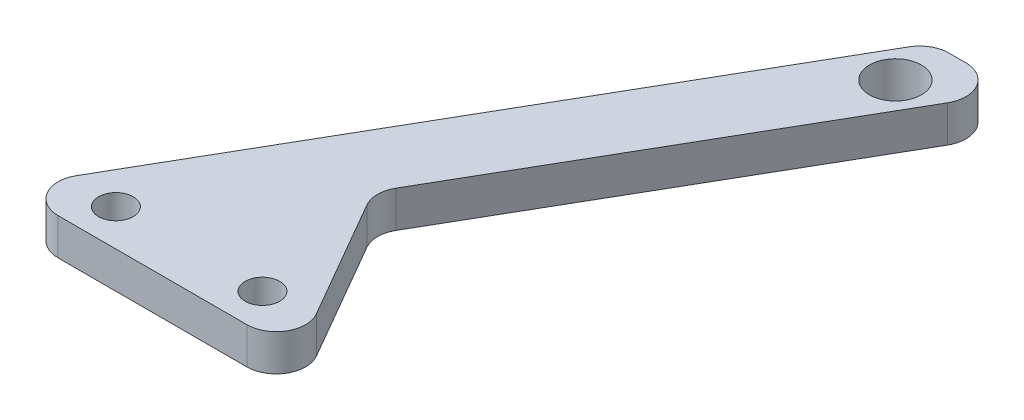
ISO-10303-21;
HEADER;
FILE_DESCRIPTION(('STEP AP214'),'2;1');
FILE_NAME('part.step','',(''),(''),'','','');
FILE_SCHEMA(('AUTOMOTIVE_DESIGN { 1 0 10303 214 1 1 1 1 }'));
ENDSEC;
DATA;
#1=APPLICATION_CONTEXT('core data for automotive mechanical design processes');
#2=APPLICATION_PROTOCOL_DEFINITION('international standard','automotive_design',2000,#1);
#3=PRODUCT_CONTEXT('',#1,'mechanical');
#4=PRODUCT('Part','Part','',(#3));
#5=PRODUCT_RELATED_PRODUCT_CATEGORY('part','',(#4));
#6=PRODUCT_DEFINITION_FORMATION('','',#4);
#7=PRODUCT_DEFINITION_CONTEXT('part definition',#1,'design');
#8=PRODUCT_DEFINITION('design','',#6,#7);
#9=PRODUCT_DEFINITION_SHAPE('','',#8);
#10=(LENGTH_UNIT() NAMED_UNIT(*) SI_UNIT(.MILLI.,.METRE.));
#11=(NAMED_UNIT(*) PLANE_ANGLE_UNIT() SI_UNIT($,.RADIAN.));
#12=(NAMED_UNIT(*) SI_UNIT($,.STERADIAN.) SOLID_ANGLE_UNIT());
#13=UNCERTAINTY_MEASURE_WITH_UNIT(LENGTH_MEASURE(1.E-05),#10,'distance_accuracy_value','');
#14=(GEOMETRIC_REPRESENTATION_CONTEXT(3) GLOBAL_UNCERTAINTY_ASSIGNED_CONTEXT((#13)) GLOBAL_UNIT_ASSIGNED_CONTEXT((#10,
#11,#12)) REPRESENTATION_CONTEXT('',''));
#15=CARTESIAN_POINT('',(0.,0.,0.));
#16=DIRECTION('',(0.,0.,1.));
#17=DIRECTION('',(1.,0.,0.));
#18=AXIS2_PLACEMENT_3D('',#15,#16,#17);
#19=CARTESIAN_POINT('',(0.,3.175,0.));
#20=DIRECTION('',(0.,1.,0.));
#21=DIRECTION('',(0.,0.,1.));
#22=AXIS2_PLACEMENT_3D('',#19,#20,#21);
#23=PLANE('',#22);
#24=CARTESIAN_POINT('',(15.8268274944324,3.175,-21.0628693429845));
#25=DIRECTION('',(0.,1.,0.));
#26=DIRECTION('',(0.,0.,1.));
#27=AXIS2_PLACEMENT_3D('',#24,#25,#26);
#28=CIRCLE('',#27,2.2479);
#29=CARTESIAN_POINT('',(15.8268274944324,3.175,-18.8149693429845));
#30=VERTEX_POINT('',#29);
#31=EDGE_CURVE('E257',#30,#30,#28,.T.);
#32=ORIENTED_EDGE('',*,*,#31,.F.);
#33=EDGE_LOOP('',(#32));
#34=FACE_BOUND('',#33,.T.);
#35=CARTESIAN_POINT('',(-8.43220068151482,3.175,22.2249999999998));
#36=DIRECTION('',(0.,1.,0.));
#37=DIRECTION('',(0.,0.,1.));
#38=AXIS2_PLACEMENT_3D('',#35,#36,#37);
#39=CIRCLE('',#38,1.5);
#40=CARTESIAN_POINT('',(-8.43220068151482,3.175,23.7249999999998));
#41=VERTEX_POINT('',#40);
#42=EDGE_CURVE('E236',#41,#41,#39,.T.);
#43=ORIENTED_EDGE('',*,*,#42,.F.);
#44=EDGE_LOOP('',(#43));
#45=FACE_BOUND('',#44,.T.);
#46=DIRECTION('',(-1.,0.,0.));
#47=VECTOR('',#46,1.);
#48=CARTESIAN_POINT('',(14.664696837417,3.175,-25.4));
#49=LINE('',#48,#47);
#50=CARTESIAN_POINT('',(17.5976362049003,3.175,-25.4));
#51=VERTEX_POINT('',#50);
#52=CARTESIAN_POINT('',(16.1311665211586,3.175,-25.4));
#53=VERTEX_POINT('',#52);
#54=EDGE_CURVE('E224',#51,#53,#49,.T.);
#55=ORIENTED_EDGE('',*,*,#54,.T.);
#56=CARTESIAN_POINT('',(16.1311665211586,3.175,-22.86));
#57=DIRECTION('',(0.,1.,0.));
#58=DIRECTION('',(0.,0.,1.));
#59=AXIS2_PLACEMENT_3D('',#56,#57,#58);
#60=CIRCLE('',#59,2.54);
#61=CARTESIAN_POINT('',(13.9314619955461,3.175,-24.13));
#62=VERTEX_POINT('',#61);
#63=EDGE_CURVE('E182',#53,#62,#60,.T.);
#64=ORIENTED_EDGE('',*,*,#63,.T.);
#65=DIRECTION('',(-0.500000000000011,0.,0.866025403784432));
#66=VECTOR('',#65,1.);
#67=CARTESIAN_POINT('',(14.664696837417,3.175,-25.4));
#68=LINE('',#67,#66);
#69=CARTESIAN_POINT('',(-12.4649923118043,3.175,21.59));
#70=VERTEX_POINT('',#69);
#71=EDGE_CURVE('E138',#62,#70,#68,.T.);
#72=ORIENTED_EDGE('',*,*,#71,.T.);
#73=CARTESIAN_POINT('',(-10.2652877861919,3.175,22.86));
#74=DIRECTION('',(0.,1.,0.));
#75=DIRECTION('',(0.,0.,1.));
#76=AXIS2_PLACEMENT_3D('',#73,#74,#75);
#77=CIRCLE('',#76,2.54);
#78=CARTESIAN_POINT('',(-10.2652877861919,3.175,25.4));
#79=VERTEX_POINT('',#78);
#80=EDGE_CURVE('E176',#70,#79,#77,.T.);
#81=ORIENTED_EDGE('',*,*,#80,.T.);
#82=DIRECTION('',(1.,0.,0.));
#83=VECTOR('',#82,1.);
#84=CARTESIAN_POINT('',(-14.6646968374169,3.175,25.4));
#85=LINE('',#84,#83);
#86=CARTESIAN_POINT('',(6.10088642316233,3.175,25.4));
#87=VERTEX_POINT('',#86);
#88=EDGE_CURVE('E148',#79,#87,#85,.T.);
#89=ORIENTED_EDGE('',*,*,#88,.T.);
#90=CARTESIAN_POINT('',(6.10088642316233,3.175,22.86));
#91=DIRECTION('',(0.,1.,0.));
#92=DIRECTION('',(0.,0.,1.));
#93=AXIS2_PLACEMENT_3D('',#90,#91,#92);
#94=CIRCLE('',#93,2.54);
#95=CARTESIAN_POINT('',(8.30059094877481,3.175,21.59));
#96=VERTEX_POINT('',#95);
#97=EDGE_CURVE('E173',#87,#96,#94,.T.);
#98=ORIENTED_EDGE('',*,*,#97,.T.);
#99=DIRECTION('',(-0.499999999999997,0.,-0.86602540378444));
#100=VECTOR('',#99,1.);
#101=CARTESIAN_POINT('',(10.5002954743873,3.175,25.4));
#102=LINE('',#101,#100);
#103=CARTESIAN_POINT('',(2.31720836971033,3.175,11.2264773719377));
#104=VERTEX_POINT('',#103);
#105=EDGE_CURVE('E154',#96,#104,#102,.T.);
#106=ORIENTED_EDGE('',*,*,#105,.T.);
#107=CARTESIAN_POINT('',(4.51691289532282,3.175,9.95647737193774));
#108=DIRECTION('',(0.,1.,0.));
#109=DIRECTION('',(0.,0.,1.));
#110=AXIS2_PLACEMENT_3D('',#107,#108,#109);
#111=CIRCLE('',#110,2.54);
#112=CARTESIAN_POINT('',(2.31720836971037,3.175,8.68647737193771));
#113=VERTEX_POINT('',#112);
#114=EDGE_CURVE('E11',#104,#113,#111,.F.);
#115=ORIENTED_EDGE('',*,*,#114,.T.);
#116=DIRECTION('',(0.500000000000011,0.,-0.866025403784432));
#117=VECTOR('',#116,1.);
#118=CARTESIAN_POINT('',(21.9970452561253,3.175,-25.4));
#119=LINE('',#118,#117);
#120=CARTESIAN_POINT('',(19.7973407305127,3.175,-21.59));
#121=VERTEX_POINT('',#120);
#122=EDGE_CURVE('E221',#113,#121,#119,.T.);
#123=ORIENTED_EDGE('',*,*,#122,.T.);
#124=CARTESIAN_POINT('',(17.5976362049003,3.175,-22.86));
#125=DIRECTION('',(0.,1.,0.));
#126=DIRECTION('',(0.,0.,1.));
#127=AXIS2_PLACEMENT_3D('',#124,#125,#126);
#128=CIRCLE('',#127,2.54);
#129=EDGE_CURVE('E179',#121,#51,#128,.T.);
#130=ORIENTED_EDGE('',*,*,#129,.T.);
#131=EDGE_LOOP('',(#55,#64,#72,#81,#89,#98,#106,#115,#123,#130));
#132=FACE_BOUND('',#131,.T.);
#133=CARTESIAN_POINT('',(4.26779931848518,3.175,22.2249999999998));
#134=DIRECTION('',(0.,1.,0.));
#135=DIRECTION('',(0.,0.,1.));
#136=AXIS2_PLACEMENT_3D('',#133,#134,#135);
#137=CIRCLE('',#136,1.5);
#138=CARTESIAN_POINT('',(4.26779931848518,3.175,23.7249999999998));
#139=VERTEX_POINT('',#138);
#140=EDGE_CURVE('E245',#139,#139,#137,.T.);
#141=ORIENTED_EDGE('',*,*,#140,.F.);
#142=EDGE_LOOP('',(#141));
#143=FACE_BOUND('',#142,.T.);
#144=ADVANCED_FACE('F39',(#34,#45,#132,#143),#23,.T.);
#145=CARTESIAN_POINT('',(0.,0.,0.));
#146=DIRECTION('',(0.,1.,0.));
#147=DIRECTION('',(0.,0.,1.));
#148=AXIS2_PLACEMENT_3D('',#145,#146,#147);
#149=PLANE('',#148);
#150=CARTESIAN_POINT('',(15.8268274944324,0.,-21.0628693429845));
#151=DIRECTION('',(0.,1.,0.));
#152=DIRECTION('',(0.,0.,1.));
#153=AXIS2_PLACEMENT_3D('',#150,#151,#152);
#154=CIRCLE('',#153,2.2479);
#155=CARTESIAN_POINT('',(15.8268274944324,0.,-18.8149693429845));
#156=VERTEX_POINT('',#155);
#157=EDGE_CURVE('E253',#156,#156,#154,.T.);
#158=ORIENTED_EDGE('',*,*,#157,.T.);
#159=EDGE_LOOP('',(#158));
#160=FACE_BOUND('',#159,.T.);
#161=DIRECTION('',(-0.500000000000011,0.,0.866025403784432));
#162=VECTOR('',#161,1.);
#163=CARTESIAN_POINT('',(14.664696837417,0.,-25.4));
#164=LINE('',#163,#162);
#165=CARTESIAN_POINT('',(13.9314619955461,0.,-24.13));
#166=VERTEX_POINT('',#165);
#167=CARTESIAN_POINT('',(-12.4649923118043,0.,21.59));
#168=VERTEX_POINT('',#167);
#169=EDGE_CURVE('E135',#166,#168,#164,.T.);
#170=ORIENTED_EDGE('',*,*,#169,.F.);
#171=CARTESIAN_POINT('',(16.1311665211586,0.,-22.86));
#172=DIRECTION('',(0.,1.,0.));
#173=DIRECTION('',(0.,0.,1.));
#174=AXIS2_PLACEMENT_3D('',#171,#172,#173);
#175=CIRCLE('',#174,2.54);
#176=CARTESIAN_POINT('',(16.1311665211586,0.,-25.4));
#177=VERTEX_POINT('',#176);
#178=EDGE_CURVE('E117',#166,#177,#175,.F.);
#179=ORIENTED_EDGE('',*,*,#178,.T.);
#180=DIRECTION('',(-1.,0.,0.));
#181=VECTOR('',#180,1.);
#182=CARTESIAN_POINT('',(14.664696837417,0.,-25.4));
#183=LINE('',#182,#181);
#184=CARTESIAN_POINT('',(17.5976362049003,0.,-25.4));
#185=VERTEX_POINT('',#184);
#186=EDGE_CURVE('E149',#185,#177,#183,.T.);
#187=ORIENTED_EDGE('',*,*,#186,.F.);
#188=CARTESIAN_POINT('',(17.5976362049003,0.,-22.86));
#189=DIRECTION('',(0.,1.,0.));
#190=DIRECTION('',(0.,0.,1.));
#191=AXIS2_PLACEMENT_3D('',#188,#189,#190);
#192=CIRCLE('',#191,2.54);
#193=CARTESIAN_POINT('',(19.7973407305127,0.,-21.59));
#194=VERTEX_POINT('',#193);
#195=EDGE_CURVE('E129',#185,#194,#192,.F.);
#196=ORIENTED_EDGE('',*,*,#195,.T.);
#197=DIRECTION('',(0.500000000000011,0.,-0.866025403784432));
#198=VECTOR('',#197,1.);
#199=CARTESIAN_POINT('',(21.9970452561253,0.,-25.4));
#200=LINE('',#199,#198);
#201=CARTESIAN_POINT('',(2.31720836971037,0.,8.68647737193771));
#202=VERTEX_POINT('',#201);
#203=EDGE_CURVE('E156',#202,#194,#200,.T.);
#204=ORIENTED_EDGE('',*,*,#203,.F.);
#205=CARTESIAN_POINT('',(4.51691289532282,0.,9.95647737193774));
#206=DIRECTION('',(0.,1.,0.));
#207=DIRECTION('',(0.,0.,1.));
#208=AXIS2_PLACEMENT_3D('',#205,#206,#207);
#209=CIRCLE('',#208,2.54);
#210=CARTESIAN_POINT('',(2.31720836971033,0.,11.2264773719377));
#211=VERTEX_POINT('',#210);
#212=EDGE_CURVE('E48',#202,#211,#209,.T.);
#213=ORIENTED_EDGE('',*,*,#212,.T.);
#214=DIRECTION('',(-0.499999999999997,0.,-0.86602540378444));
#215=VECTOR('',#214,1.);
#216=CARTESIAN_POINT('',(10.5002954743873,0.,25.4));
#217=LINE('',#216,#215);
#218=CARTESIAN_POINT('',(8.30059094877481,0.,21.59));
#219=VERTEX_POINT('',#218);
#220=EDGE_CURVE('E208',#219,#211,#217,.T.);
#221=ORIENTED_EDGE('',*,*,#220,.F.);
#222=CARTESIAN_POINT('',(6.10088642316233,0.,22.86));
#223=DIRECTION('',(0.,1.,0.));
#224=DIRECTION('',(0.,0.,1.));
#225=AXIS2_PLACEMENT_3D('',#222,#223,#224);
#226=CIRCLE('',#225,2.54);
#227=CARTESIAN_POINT('',(6.10088642316233,0.,25.4));
#228=VERTEX_POINT('',#227);
#229=EDGE_CURVE('E140',#219,#228,#226,.F.);
#230=ORIENTED_EDGE('',*,*,#229,.T.);
#231=DIRECTION('',(1.,0.,0.));
#232=VECTOR('',#231,1.);
#233=CARTESIAN_POINT('',(-14.6646968374169,0.,25.4));
#234=LINE('',#233,#232);
#235=CARTESIAN_POINT('',(-10.2652877861919,0.,25.4));
#236=VERTEX_POINT('',#235);
#237=EDGE_CURVE('E217',#236,#228,#234,.T.);
#238=ORIENTED_EDGE('',*,*,#237,.F.);
#239=CARTESIAN_POINT('',(-10.2652877861919,0.,22.86));
#240=DIRECTION('',(0.,1.,0.));
#241=DIRECTION('',(0.,0.,1.));
#242=AXIS2_PLACEMENT_3D('',#239,#240,#241);
#243=CIRCLE('',#242,2.54);
#244=EDGE_CURVE('E146',#236,#168,#243,.F.);
#245=ORIENTED_EDGE('',*,*,#244,.T.);
#246=EDGE_LOOP('',(#170,#179,#187,#196,#204,#213,#221,#230,#238,#245));
#247=FACE_BOUND('',#246,.T.);
#248=CARTESIAN_POINT('',(-8.43220068151482,0.,22.2249999999998));
#249=DIRECTION('',(0.,1.,0.));
#250=DIRECTION('',(0.,0.,1.));
#251=AXIS2_PLACEMENT_3D('',#248,#249,#250);
#252=CIRCLE('',#251,1.5);
#253=CARTESIAN_POINT('',(-8.43220068151482,0.,23.7249999999998));
#254=VERTEX_POINT('',#253);
#255=EDGE_CURVE('E241',#254,#254,#252,.T.);
#256=ORIENTED_EDGE('',*,*,#255,.T.);
#257=EDGE_LOOP('',(#256));
#258=FACE_BOUND('',#257,.T.);
#259=CARTESIAN_POINT('',(4.26779931848518,0.,22.2249999999998));
#260=DIRECTION('',(0.,1.,0.));
#261=DIRECTION('',(0.,0.,1.));
#262=AXIS2_PLACEMENT_3D('',#259,#260,#261);
#263=CIRCLE('',#262,1.5);
#264=CARTESIAN_POINT('',(4.26779931848518,0.,23.7249999999998));
#265=VERTEX_POINT('',#264);
#266=EDGE_CURVE('E249',#265,#265,#263,.T.);
#267=ORIENTED_EDGE('',*,*,#266,.T.);
#268=EDGE_LOOP('',(#267));
#269=FACE_BOUND('',#268,.T.);
#270=ADVANCED_FACE('F143',(#160,#247,#258,#269),#149,.F.);
#271=CARTESIAN_POINT('',(-14.6646968374169,3.175,25.4));
#272=DIRECTION('',(0.,0.,-1.));
#273=DIRECTION('',(-1.,0.,0.));
#274=AXIS2_PLACEMENT_3D('',#271,#272,#273);
#275=PLANE('',#274);
#276=ORIENTED_EDGE('',*,*,#88,.F.);
#277=DIRECTION('',(0.,-1.,0.));
#278=VECTOR('',#277,1.);
#279=CARTESIAN_POINT('',(-10.2652877861919,3.175,25.4));
#280=LINE('',#279,#278);
#281=EDGE_CURVE('E194',#79,#236,#280,.T.);
#282=ORIENTED_EDGE('',*,*,#281,.T.);
#283=ORIENTED_EDGE('',*,*,#237,.T.);
#284=DIRECTION('',(0.,-1.,0.));
#285=VECTOR('',#284,1.);
#286=CARTESIAN_POINT('',(6.10088642316233,3.175,25.4));
#287=LINE('',#286,#285);
#288=EDGE_CURVE('E191',#228,#87,#287,.F.);
#289=ORIENTED_EDGE('',*,*,#288,.T.);
#290=EDGE_LOOP('',(#276,#282,#283,#289));
#291=FACE_BOUND('',#290,.T.);
#292=ADVANCED_FACE('F281',(#291),#275,.F.);
#293=CARTESIAN_POINT('',(10.5002954743873,3.175,25.4));
#294=DIRECTION('',(-0.86602540378444,0.,0.499999999999997));
#295=DIRECTION('',(0.499999999999997,0.,0.86602540378444));
#296=AXIS2_PLACEMENT_3D('',#293,#294,#295);
#297=PLANE('',#296);
#298=ORIENTED_EDGE('',*,*,#220,.T.);
#299=DIRECTION('',(0.,-1.,0.));
#300=VECTOR('',#299,1.);
#301=CARTESIAN_POINT('',(2.31720836971033,3.175,11.2264773719377));
#302=LINE('',#301,#300);
#303=EDGE_CURVE('E202',#211,#104,#302,.F.);
#304=ORIENTED_EDGE('',*,*,#303,.T.);
#305=ORIENTED_EDGE('',*,*,#105,.F.);
#306=DIRECTION('',(0.,-1.,0.));
#307=VECTOR('',#306,1.);
#308=CARTESIAN_POINT('',(8.30059094877481,3.175,21.59));
#309=LINE('',#308,#307);
#310=EDGE_CURVE('E198',#96,#219,#309,.T.);
#311=ORIENTED_EDGE('',*,*,#310,.T.);
#312=EDGE_LOOP('',(#298,#304,#305,#311));
#313=FACE_BOUND('',#312,.T.);
#314=ADVANCED_FACE('F213',(#313),#297,.F.);
#315=CARTESIAN_POINT('',(21.9970452561253,3.175,-25.4));
#316=DIRECTION('',(-0.866025403784432,0.,-0.500000000000011));
#317=DIRECTION('',(-0.500000000000011,0.,0.866025403784432));
#318=AXIS2_PLACEMENT_3D('',#315,#316,#317);
#319=PLANE('',#318);
#320=ORIENTED_EDGE('',*,*,#203,.T.);
#321=DIRECTION('',(0.,-1.,0.));
#322=VECTOR('',#321,1.);
#323=CARTESIAN_POINT('',(19.7973407305127,3.175,-21.59));
#324=LINE('',#323,#322);
#325=EDGE_CURVE('E55',#194,#121,#324,.F.);
#326=ORIENTED_EDGE('',*,*,#325,.T.);
#327=ORIENTED_EDGE('',*,*,#122,.F.);
#328=DIRECTION('',(0.,-1.,0.));
#329=VECTOR('',#328,1.);
#330=CARTESIAN_POINT('',(2.31720836971036,0.,8.68647737193771));
#331=LINE('',#330,#329);
#332=EDGE_CURVE('E185',#113,#202,#331,.T.);
#333=ORIENTED_EDGE('',*,*,#332,.T.);
#334=EDGE_LOOP('',(#320,#326,#327,#333));
#335=FACE_BOUND('',#334,.T.);
#336=ADVANCED_FACE('F220',(#335),#319,.F.);
#337=CARTESIAN_POINT('',(14.664696837417,3.175,-25.4));
#338=DIRECTION('',(0.,0.,1.));
#339=DIRECTION('',(1.,0.,0.));
#340=AXIS2_PLACEMENT_3D('',#337,#338,#339);
#341=PLANE('',#340);
#342=ORIENTED_EDGE('',*,*,#186,.T.);
#343=DIRECTION('',(0.,-1.,0.));
#344=VECTOR('',#343,1.);
#345=CARTESIAN_POINT('',(16.1311665211586,3.175,-25.4));
#346=LINE('',#345,#344);
#347=EDGE_CURVE('E122',#177,#53,#346,.F.);
#348=ORIENTED_EDGE('',*,*,#347,.T.);
#349=ORIENTED_EDGE('',*,*,#54,.F.);
#350=DIRECTION('',(0.,-1.,0.));
#351=VECTOR('',#350,1.);
#352=CARTESIAN_POINT('',(17.5976362049003,3.175,-25.4));
#353=LINE('',#352,#351);
#354=EDGE_CURVE('E128',#51,#185,#353,.T.);
#355=ORIENTED_EDGE('',*,*,#354,.T.);
#356=EDGE_LOOP('',(#342,#348,#349,#355));
#357=FACE_BOUND('',#356,.T.);
#358=ADVANCED_FACE('F293',(#357),#341,.F.);
#359=CARTESIAN_POINT('',(14.664696837417,3.175,-25.4));
#360=DIRECTION('',(0.866025403784432,0.,0.500000000000011));
#361=DIRECTION('',(0.500000000000011,0.,-0.866025403784432));
#362=AXIS2_PLACEMENT_3D('',#359,#360,#361);
#363=PLANE('',#362);
#364=ORIENTED_EDGE('',*,*,#71,.F.);
#365=DIRECTION('',(0.,-1.,0.));
#366=VECTOR('',#365,1.);
#367=CARTESIAN_POINT('',(13.9314619955461,3.175,-24.13));
#368=LINE('',#367,#366);
#369=EDGE_CURVE('E121',#62,#166,#368,.T.);
#370=ORIENTED_EDGE('',*,*,#369,.T.);
#371=ORIENTED_EDGE('',*,*,#169,.T.);
#372=DIRECTION('',(0.,-1.,0.));
#373=VECTOR('',#372,1.);
#374=CARTESIAN_POINT('',(-12.4649923118043,3.175,21.59));
#375=LINE('',#374,#373);
#376=EDGE_CURVE('E141',#168,#70,#375,.F.);
#377=ORIENTED_EDGE('',*,*,#376,.T.);
#378=EDGE_LOOP('',(#364,#370,#371,#377));
#379=FACE_BOUND('',#378,.T.);
#380=ADVANCED_FACE('F134',(#379),#363,.F.);
#381=CARTESIAN_POINT('',(-8.43220068151482,3.175,22.2249999999998));
#382=DIRECTION('',(0.,-1.,0.));
#383=DIRECTION('',(0.,0.,-1.));
#384=AXIS2_PLACEMENT_3D('',#381,#382,#383);
#385=CYLINDRICAL_SURFACE('',#384,1.5);
#386=ORIENTED_EDGE('',*,*,#42,.T.);
#387=EDGE_LOOP('',(#386));
#388=FACE_BOUND('',#387,.T.);
#389=ORIENTED_EDGE('',*,*,#255,.F.);
#390=EDGE_LOOP('',(#389));
#391=FACE_BOUND('',#390,.T.);
#392=ADVANCED_FACE('F276',(#388,#391),#385,.F.);
#393=CARTESIAN_POINT('',(4.26779931848518,3.175,22.2249999999998));
#394=DIRECTION('',(0.,-1.,0.));
#395=DIRECTION('',(0.,0.,-1.));
#396=AXIS2_PLACEMENT_3D('',#393,#394,#395);
#397=CYLINDRICAL_SURFACE('',#396,1.5);
#398=ORIENTED_EDGE('',*,*,#140,.T.);
#399=EDGE_LOOP('',(#398));
#400=FACE_BOUND('',#399,.T.);
#401=ORIENTED_EDGE('',*,*,#266,.F.);
#402=EDGE_LOOP('',(#401));
#403=FACE_BOUND('',#402,.T.);
#404=ADVANCED_FACE('F273',(#400,#403),#397,.F.);
#405=CARTESIAN_POINT('',(15.8268274944324,0.,-21.0628693429845));
#406=DIRECTION('',(0.,1.,0.));
#407=DIRECTION('',(0.,0.,1.));
#408=AXIS2_PLACEMENT_3D('',#405,#406,#407);
#409=CYLINDRICAL_SURFACE('',#408,2.2479);
#410=ORIENTED_EDGE('',*,*,#157,.F.);
#411=EDGE_LOOP('',(#410));
#412=FACE_BOUND('',#411,.T.);
#413=ORIENTED_EDGE('',*,*,#31,.T.);
#414=EDGE_LOOP('',(#413));
#415=FACE_BOUND('',#414,.T.);
#416=ADVANCED_FACE('F263',(#412,#415),#409,.F.);
#417=CARTESIAN_POINT('',(16.1311665211586,3.175,-22.86));
#418=DIRECTION('',(0.,-1.,0.));
#419=DIRECTION('',(0.,0.,-1.));
#420=AXIS2_PLACEMENT_3D('',#417,#418,#419);
#421=CYLINDRICAL_SURFACE('',#420,2.54);
#422=ORIENTED_EDGE('',*,*,#63,.F.);
#423=ORIENTED_EDGE('',*,*,#347,.F.);
#424=ORIENTED_EDGE('',*,*,#178,.F.);
#425=ORIENTED_EDGE('',*,*,#369,.F.);
#426=EDGE_LOOP('',(#422,#423,#424,#425));
#427=FACE_BOUND('',#426,.T.);
#428=ADVANCED_FACE('F120',(#427),#421,.T.);
#429=CARTESIAN_POINT('',(17.5976362049003,3.175,-22.86));
#430=DIRECTION('',(0.,-1.,0.));
#431=DIRECTION('',(0.,0.,-1.));
#432=AXIS2_PLACEMENT_3D('',#429,#430,#431);
#433=CYLINDRICAL_SURFACE('',#432,2.54);
#434=ORIENTED_EDGE('',*,*,#129,.F.);
#435=ORIENTED_EDGE('',*,*,#325,.F.);
#436=ORIENTED_EDGE('',*,*,#195,.F.);
#437=ORIENTED_EDGE('',*,*,#354,.F.);
#438=EDGE_LOOP('',(#434,#435,#436,#437));
#439=FACE_BOUND('',#438,.T.);
#440=ADVANCED_FACE('F303',(#439),#433,.T.);
#441=CARTESIAN_POINT('',(-10.2652877861919,3.175,22.86));
#442=DIRECTION('',(0.,-1.,0.));
#443=DIRECTION('',(0.,0.,-1.));
#444=AXIS2_PLACEMENT_3D('',#441,#442,#443);
#445=CYLINDRICAL_SURFACE('',#444,2.54);
#446=ORIENTED_EDGE('',*,*,#80,.F.);
#447=ORIENTED_EDGE('',*,*,#376,.F.);
#448=ORIENTED_EDGE('',*,*,#244,.F.);
#449=ORIENTED_EDGE('',*,*,#281,.F.);
#450=EDGE_LOOP('',(#446,#447,#448,#449));
#451=FACE_BOUND('',#450,.T.);
#452=ADVANCED_FACE('F306',(#451),#445,.T.);
#453=CARTESIAN_POINT('',(4.51691289532282,3.175,9.95647737193774));
#454=DIRECTION('',(0.,1.,0.));
#455=DIRECTION('',(0.,0.,1.));
#456=AXIS2_PLACEMENT_3D('',#453,#454,#455);
#457=CYLINDRICAL_SURFACE('',#456,2.54);
#458=ORIENTED_EDGE('',*,*,#114,.F.);
#459=ORIENTED_EDGE('',*,*,#303,.F.);
#460=ORIENTED_EDGE('',*,*,#212,.F.);
#461=ORIENTED_EDGE('',*,*,#332,.F.);
#462=EDGE_LOOP('',(#458,#459,#460,#461));
#463=FACE_BOUND('',#462,.T.);
#464=ADVANCED_FACE('F219',(#463),#457,.F.);
#465=CARTESIAN_POINT('',(6.10088642316233,3.175,22.86));
#466=DIRECTION('',(0.,-1.,0.));
#467=DIRECTION('',(0.,0.,-1.));
#468=AXIS2_PLACEMENT_3D('',#465,#466,#467);
#469=CYLINDRICAL_SURFACE('',#468,2.54);
#470=ORIENTED_EDGE('',*,*,#97,.F.);
#471=ORIENTED_EDGE('',*,*,#288,.F.);
#472=ORIENTED_EDGE('',*,*,#229,.F.);
#473=ORIENTED_EDGE('',*,*,#310,.F.);
#474=EDGE_LOOP('',(#470,#471,#472,#473));
#475=FACE_BOUND('',#474,.T.);
#476=ADVANCED_FACE('F41',(#475),#469,.T.);
#477=CLOSED_SHELL('',(#144,#270,#292,#314,#336,#358,#380,#392,#404,#416,#428,#440,#452,#464,#476));
#478=MANIFOLD_SOLID_BREP('B2',#477);
#479=ADVANCED_BREP_SHAPE_REPRESENTATION('',(#18,#478),#14);
#480=SHAPE_DEFINITION_REPRESENTATION(#9,#479);
ENDSEC;
END-ISO-10303-21;
